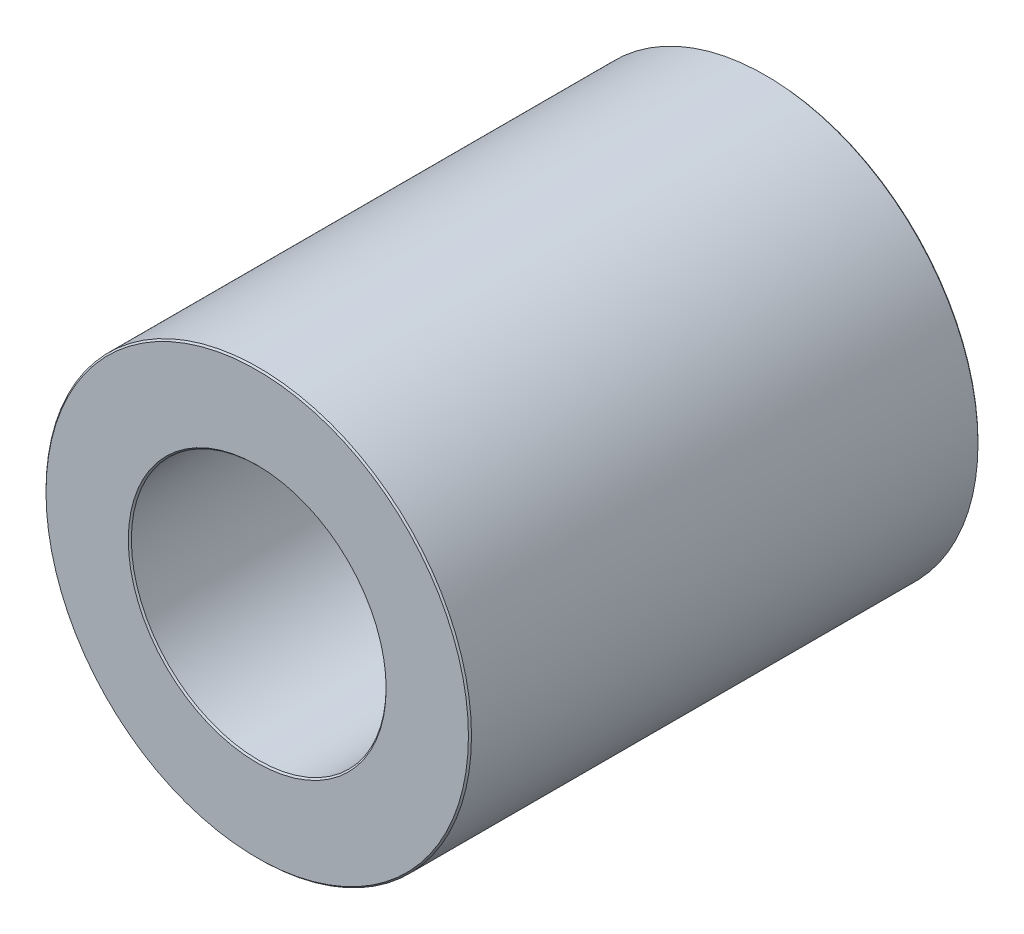
ISO-10303-21;
HEADER;
FILE_DESCRIPTION(('STEP AP214'),'2;1');
FILE_NAME('part.step','',(''),(''),'','','');
FILE_SCHEMA(('AUTOMOTIVE_DESIGN { 1 0 10303 214 1 1 1 1 }'));
ENDSEC;
DATA;
#1=APPLICATION_CONTEXT('core data for automotive mechanical design processes');
#2=APPLICATION_PROTOCOL_DEFINITION('international standard','automotive_design',2000,#1);
#3=PRODUCT_CONTEXT('',#1,'mechanical');
#4=PRODUCT('Part','Part','',(#3));
#5=PRODUCT_RELATED_PRODUCT_CATEGORY('part','',(#4));
#6=PRODUCT_DEFINITION_FORMATION('','',#4);
#7=PRODUCT_DEFINITION_CONTEXT('part definition',#1,'design');
#8=PRODUCT_DEFINITION('design','',#6,#7);
#9=PRODUCT_DEFINITION_SHAPE('','',#8);
#10=(LENGTH_UNIT() NAMED_UNIT(*) SI_UNIT(.MILLI.,.METRE.));
#11=(NAMED_UNIT(*) PLANE_ANGLE_UNIT() SI_UNIT($,.RADIAN.));
#12=(NAMED_UNIT(*) SI_UNIT($,.STERADIAN.) SOLID_ANGLE_UNIT());
#13=UNCERTAINTY_MEASURE_WITH_UNIT(LENGTH_MEASURE(1.E-05),#10,'distance_accuracy_value','');
#14=(GEOMETRIC_REPRESENTATION_CONTEXT(3) GLOBAL_UNCERTAINTY_ASSIGNED_CONTEXT((#13)) GLOBAL_UNIT_ASSIGNED_CONTEXT((#10,
#11,#12)) REPRESENTATION_CONTEXT('',''));
#15=CARTESIAN_POINT('',(0.,0.,0.));
#16=DIRECTION('',(0.,0.,1.));
#17=DIRECTION('',(1.,0.,0.));
#18=AXIS2_PLACEMENT_3D('',#15,#16,#17);
#19=CARTESIAN_POINT('',(0.,0.,6.));
#20=DIRECTION('',(0.,0.,1.));
#21=DIRECTION('',(1.,0.,0.));
#22=AXIS2_PLACEMENT_3D('',#19,#20,#21);
#23=PLANE('',#22);
#24=CARTESIAN_POINT('',(0.,0.,6.));
#25=DIRECTION('',(0.,0.,1.));
#26=DIRECTION('',(1.,0.,0.));
#27=AXIS2_PLACEMENT_3D('',#24,#25,#26);
#28=CIRCLE('',#27,3.036);
#29=CARTESIAN_POINT('',(3.036,0.,6.));
#30=VERTEX_POINT('',#29);
#31=EDGE_CURVE('E10',#30,#30,#28,.F.);
#32=ORIENTED_EDGE('',*,*,#31,.T.);
#33=EDGE_LOOP('',(#32));
#34=FACE_BOUND('',#33,.T.);
#35=CARTESIAN_POINT('',(0.,0.,6.));
#36=DIRECTION('',(0.,0.,1.));
#37=DIRECTION('',(1.,0.,0.));
#38=AXIS2_PLACEMENT_3D('',#35,#36,#37);
#39=CIRCLE('',#38,4.974);
#40=CARTESIAN_POINT('',(4.974,0.,6.));
#41=VERTEX_POINT('',#40);
#42=EDGE_CURVE('E47',#41,#41,#39,.T.);
#43=ORIENTED_EDGE('',*,*,#42,.T.);
#44=EDGE_LOOP('',(#43));
#45=FACE_BOUND('',#44,.T.);
#46=ADVANCED_FACE('F39',(#34,#45),#23,.T.);
#47=CARTESIAN_POINT('',(0.,0.,6.));
#48=DIRECTION('',(0.,0.,-1.));
#49=DIRECTION('',(-1.,0.,0.));
#50=AXIS2_PLACEMENT_3D('',#47,#48,#49);
#51=CYLINDRICAL_SURFACE('',#50,5.01);
#52=CARTESIAN_POINT('',(0.,0.,-5.964));
#53=DIRECTION('',(0.,0.,1.));
#54=DIRECTION('',(1.,0.,0.));
#55=AXIS2_PLACEMENT_3D('',#52,#53,#54);
#56=CIRCLE('',#55,5.01);
#57=CARTESIAN_POINT('',(5.01,0.,-5.964));
#58=VERTEX_POINT('',#57);
#59=EDGE_CURVE('E69',#58,#58,#56,.T.);
#60=ORIENTED_EDGE('',*,*,#59,.T.);
#61=EDGE_LOOP('',(#60));
#62=FACE_BOUND('',#61,.T.);
#63=CARTESIAN_POINT('',(0.,0.,5.96399999999999));
#64=DIRECTION('',(0.,0.,1.));
#65=DIRECTION('',(1.,0.,0.));
#66=AXIS2_PLACEMENT_3D('',#63,#64,#65);
#67=CIRCLE('',#66,5.01);
#68=CARTESIAN_POINT('',(5.01,0.,5.96399999999999));
#69=VERTEX_POINT('',#68);
#70=EDGE_CURVE('E72',#69,#69,#67,.F.);
#71=ORIENTED_EDGE('',*,*,#70,.T.);
#72=EDGE_LOOP('',(#71));
#73=FACE_BOUND('',#72,.T.);
#74=ADVANCED_FACE('F76',(#62,#73),#51,.T.);
#75=CARTESIAN_POINT('',(0.,0.,6.));
#76=DIRECTION('',(0.,0.,-1.));
#77=DIRECTION('',(-1.,0.,0.));
#78=AXIS2_PLACEMENT_3D('',#75,#76,#77);
#79=CYLINDRICAL_SURFACE('',#78,3.);
#80=CARTESIAN_POINT('',(0.,0.,-5.964));
#81=DIRECTION('',(0.,0.,1.));
#82=DIRECTION('',(1.,0.,0.));
#83=AXIS2_PLACEMENT_3D('',#80,#81,#82);
#84=CIRCLE('',#83,3.);
#85=CARTESIAN_POINT('',(3.,0.,-5.964));
#86=VERTEX_POINT('',#85);
#87=EDGE_CURVE('E54',#86,#86,#84,.F.);
#88=ORIENTED_EDGE('',*,*,#87,.T.);
#89=EDGE_LOOP('',(#88));
#90=FACE_BOUND('',#89,.T.);
#91=CARTESIAN_POINT('',(0.,0.,5.964));
#92=DIRECTION('',(0.,0.,1.));
#93=DIRECTION('',(1.,0.,0.));
#94=AXIS2_PLACEMENT_3D('',#91,#92,#93);
#95=CIRCLE('',#94,3.);
#96=CARTESIAN_POINT('',(3.,0.,5.964));
#97=VERTEX_POINT('',#96);
#98=EDGE_CURVE('E58',#97,#97,#95,.T.);
#99=ORIENTED_EDGE('',*,*,#98,.T.);
#100=EDGE_LOOP('',(#99));
#101=FACE_BOUND('',#100,.T.);
#102=ADVANCED_FACE('F92',(#90,#101),#79,.F.);
#103=CARTESIAN_POINT('',(0.,0.,-6.));
#104=DIRECTION('',(0.,0.,1.));
#105=DIRECTION('',(1.,0.,0.));
#106=AXIS2_PLACEMENT_3D('',#103,#104,#105);
#107=PLANE('',#106);
#108=CARTESIAN_POINT('',(0.,0.,-6.));
#109=DIRECTION('',(0.,0.,1.));
#110=DIRECTION('',(1.,0.,0.));
#111=AXIS2_PLACEMENT_3D('',#108,#109,#110);
#112=CIRCLE('',#111,4.974);
#113=CARTESIAN_POINT('',(4.974,0.,-6.));
#114=VERTEX_POINT('',#113);
#115=EDGE_CURVE('E63',#114,#114,#112,.F.);
#116=ORIENTED_EDGE('',*,*,#115,.T.);
#117=EDGE_LOOP('',(#116));
#118=FACE_BOUND('',#117,.T.);
#119=CARTESIAN_POINT('',(0.,0.,-6.));
#120=DIRECTION('',(0.,0.,1.));
#121=DIRECTION('',(1.,0.,0.));
#122=AXIS2_PLACEMENT_3D('',#119,#120,#121);
#123=CIRCLE('',#122,3.036);
#124=CARTESIAN_POINT('',(3.036,0.,-6.));
#125=VERTEX_POINT('',#124);
#126=EDGE_CURVE('E66',#125,#125,#123,.T.);
#127=ORIENTED_EDGE('',*,*,#126,.T.);
#128=EDGE_LOOP('',(#127));
#129=FACE_BOUND('',#128,.T.);
#130=ADVANCED_FACE('F101',(#118,#129),#107,.F.);
#131=CARTESIAN_POINT('',(0.,0.,-5.964));
#132=DIRECTION('',(0.,0.,1.));
#133=DIRECTION('',(1.,0.,0.));
#134=AXIS2_PLACEMENT_3D('',#131,#132,#133);
#135=CONICAL_SURFACE('',#134,5.01,0.785398163397424);
#136=ORIENTED_EDGE('',*,*,#115,.F.);
#137=EDGE_LOOP('',(#136));
#138=FACE_BOUND('',#137,.T.);
#139=ORIENTED_EDGE('',*,*,#59,.F.);
#140=EDGE_LOOP('',(#139));
#141=FACE_BOUND('',#140,.T.);
#142=ADVANCED_FACE('F98',(#138,#141),#135,.T.);
#143=CARTESIAN_POINT('',(0.,0.,-6.));
#144=DIRECTION('',(0.,0.,-1.));
#145=DIRECTION('',(-1.,0.,0.));
#146=AXIS2_PLACEMENT_3D('',#143,#144,#145);
#147=CONICAL_SURFACE('',#146,3.036,0.785398163397442);
#148=ORIENTED_EDGE('',*,*,#87,.F.);
#149=EDGE_LOOP('',(#148));
#150=FACE_BOUND('',#149,.T.);
#151=ORIENTED_EDGE('',*,*,#126,.F.);
#152=EDGE_LOOP('',(#151));
#153=FACE_BOUND('',#152,.T.);
#154=ADVANCED_FACE('F84',(#150,#153),#147,.F.);
#155=CARTESIAN_POINT('',(0.,0.,5.964));
#156=DIRECTION('',(0.,0.,1.));
#157=DIRECTION('',(1.,0.,0.));
#158=AXIS2_PLACEMENT_3D('',#155,#156,#157);
#159=CONICAL_SURFACE('',#158,3.,0.785398163397442);
#160=ORIENTED_EDGE('',*,*,#31,.F.);
#161=EDGE_LOOP('',(#160));
#162=FACE_BOUND('',#161,.T.);
#163=ORIENTED_EDGE('',*,*,#98,.F.);
#164=EDGE_LOOP('',(#163));
#165=FACE_BOUND('',#164,.T.);
#166=ADVANCED_FACE('F80',(#162,#165),#159,.F.);
#167=CARTESIAN_POINT('',(0.,0.,6.));
#168=DIRECTION('',(0.,0.,-1.));
#169=DIRECTION('',(-1.,0.,0.));
#170=AXIS2_PLACEMENT_3D('',#167,#168,#169);
#171=CONICAL_SURFACE('',#170,4.974,0.785398163397412);
#172=ORIENTED_EDGE('',*,*,#70,.F.);
#173=EDGE_LOOP('',(#172));
#174=FACE_BOUND('',#173,.T.);
#175=ORIENTED_EDGE('',*,*,#42,.F.);
#176=EDGE_LOOP('',(#175));
#177=FACE_BOUND('',#176,.T.);
#178=ADVANCED_FACE('F41',(#174,#177),#171,.T.);
#179=CLOSED_SHELL('',(#46,#74,#102,#130,#142,#154,#166,#178));
#180=MANIFOLD_SOLID_BREP('B2',#179);
#181=ADVANCED_BREP_SHAPE_REPRESENTATION('',(#18,#180),#14);
#182=SHAPE_DEFINITION_REPRESENTATION(#9,#181);
ENDSEC;
END-ISO-10303-21;
